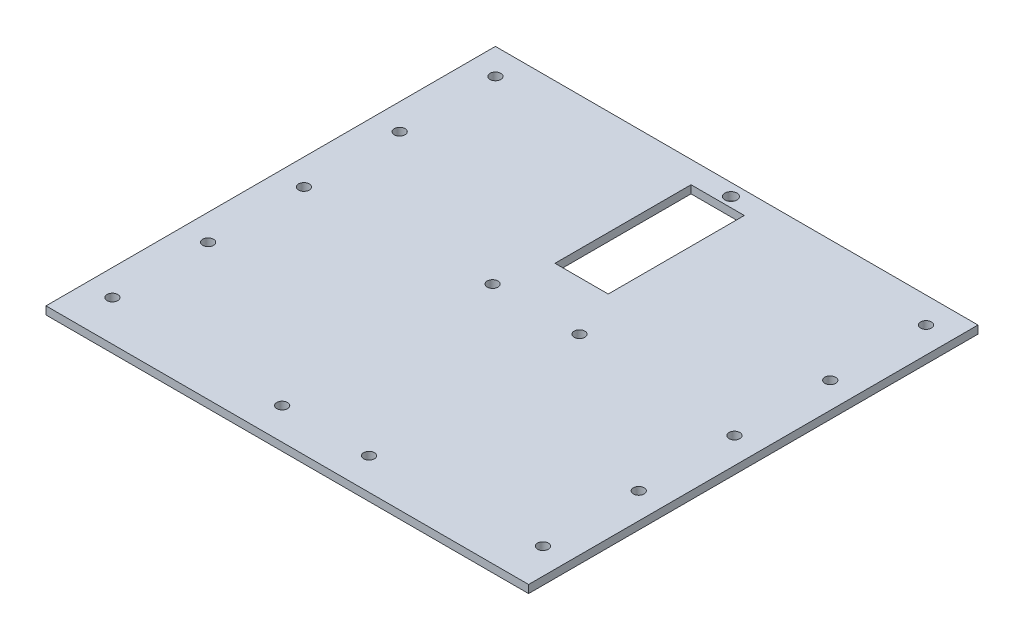
ISO-10303-21;
HEADER;
FILE_DESCRIPTION(('STEP AP214'),'2;1');
FILE_NAME('part.step','',(''),(''),'','','');
FILE_SCHEMA(('AUTOMOTIVE_DESIGN { 1 0 10303 214 1 1 1 1 }'));
ENDSEC;
DATA;
#1=APPLICATION_CONTEXT('core data for automotive mechanical design processes');
#2=APPLICATION_PROTOCOL_DEFINITION('international standard','automotive_design',2000,#1);
#3=PRODUCT_CONTEXT('',#1,'mechanical');
#4=PRODUCT('Part','Part','',(#3));
#5=PRODUCT_RELATED_PRODUCT_CATEGORY('part','',(#4));
#6=PRODUCT_DEFINITION_FORMATION('','',#4);
#7=PRODUCT_DEFINITION_CONTEXT('part definition',#1,'design');
#8=PRODUCT_DEFINITION('design','',#6,#7);
#9=PRODUCT_DEFINITION_SHAPE('','',#8);
#10=(LENGTH_UNIT() NAMED_UNIT(*) SI_UNIT(.MILLI.,.METRE.));
#11=(NAMED_UNIT(*) PLANE_ANGLE_UNIT() SI_UNIT($,.RADIAN.));
#12=(NAMED_UNIT(*) SI_UNIT($,.STERADIAN.) SOLID_ANGLE_UNIT());
#13=UNCERTAINTY_MEASURE_WITH_UNIT(LENGTH_MEASURE(1.E-05),#10,'distance_accuracy_value','');
#14=(GEOMETRIC_REPRESENTATION_CONTEXT(3) GLOBAL_UNCERTAINTY_ASSIGNED_CONTEXT((#13)) GLOBAL_UNIT_ASSIGNED_CONTEXT((#10,
#11,#12)) REPRESENTATION_CONTEXT('',''));
#15=CARTESIAN_POINT('',(0.,0.,0.));
#16=DIRECTION('',(0.,0.,1.));
#17=DIRECTION('',(1.,0.,0.));
#18=AXIS2_PLACEMENT_3D('',#15,#16,#17);
#19=CARTESIAN_POINT('',(-96.647,3.175,90.));
#20=DIRECTION('',(1.,0.,0.));
#21=DIRECTION('',(0.,0.,-1.));
#22=AXIS2_PLACEMENT_3D('',#19,#20,#21);
#23=PLANE('',#22);
#24=DIRECTION('',(0.,0.,1.));
#25=VECTOR('',#24,1.);
#26=CARTESIAN_POINT('',(-96.647,0.,90.));
#27=LINE('',#26,#25);
#28=CARTESIAN_POINT('',(-96.647,0.,-90.));
#29=VERTEX_POINT('',#28);
#30=CARTESIAN_POINT('',(-96.647,0.,90.));
#31=VERTEX_POINT('',#30);
#32=EDGE_CURVE('E225',#29,#31,#27,.T.);
#33=ORIENTED_EDGE('',*,*,#32,.T.);
#34=DIRECTION('',(0.,-1.,0.));
#35=VECTOR('',#34,1.);
#36=CARTESIAN_POINT('',(-96.647,3.175,90.));
#37=LINE('',#36,#35);
#38=CARTESIAN_POINT('',(-96.647,3.175,90.));
#39=VERTEX_POINT('',#38);
#40=EDGE_CURVE('E11',#39,#31,#37,.T.);
#41=ORIENTED_EDGE('',*,*,#40,.F.);
#42=DIRECTION('',(0.,0.,1.));
#43=VECTOR('',#42,1.);
#44=CARTESIAN_POINT('',(-96.647,3.175,90.));
#45=LINE('',#44,#43);
#46=CARTESIAN_POINT('',(-96.647,3.175,-90.));
#47=VERTEX_POINT('',#46);
#48=EDGE_CURVE('E228',#47,#39,#45,.T.);
#49=ORIENTED_EDGE('',*,*,#48,.F.);
#50=DIRECTION('',(0.,-1.,0.));
#51=VECTOR('',#50,1.);
#52=CARTESIAN_POINT('',(-96.647,3.175,-90.));
#53=LINE('',#52,#51);
#54=EDGE_CURVE('E238',#47,#29,#53,.T.);
#55=ORIENTED_EDGE('',*,*,#54,.T.);
#56=EDGE_LOOP('',(#33,#41,#49,#55));
#57=FACE_BOUND('',#56,.T.);
#58=ADVANCED_FACE('F37',(#57),#23,.F.);
#59=CARTESIAN_POINT('',(96.647,3.175,90.));
#60=DIRECTION('',(0.,0.,-1.));
#61=DIRECTION('',(-1.,0.,0.));
#62=AXIS2_PLACEMENT_3D('',#59,#60,#61);
#63=PLANE('',#62);
#64=DIRECTION('',(1.,0.,0.));
#65=VECTOR('',#64,1.);
#66=CARTESIAN_POINT('',(96.647,0.,90.));
#67=LINE('',#66,#65);
#68=CARTESIAN_POINT('',(96.647,0.,90.));
#69=VERTEX_POINT('',#68);
#70=EDGE_CURVE('E241',#31,#69,#67,.T.);
#71=ORIENTED_EDGE('',*,*,#70,.T.);
#72=DIRECTION('',(0.,-1.,0.));
#73=VECTOR('',#72,1.);
#74=CARTESIAN_POINT('',(96.647,3.175,90.));
#75=LINE('',#74,#73);
#76=CARTESIAN_POINT('',(96.647,3.175,90.));
#77=VERTEX_POINT('',#76);
#78=EDGE_CURVE('E44',#77,#69,#75,.T.);
#79=ORIENTED_EDGE('',*,*,#78,.F.);
#80=DIRECTION('',(1.,0.,0.));
#81=VECTOR('',#80,1.);
#82=CARTESIAN_POINT('',(96.647,3.175,90.));
#83=LINE('',#82,#81);
#84=EDGE_CURVE('E231',#39,#77,#83,.T.);
#85=ORIENTED_EDGE('',*,*,#84,.F.);
#86=ORIENTED_EDGE('',*,*,#40,.T.);
#87=EDGE_LOOP('',(#71,#79,#85,#86));
#88=FACE_BOUND('',#87,.T.);
#89=ADVANCED_FACE('F270',(#88),#63,.F.);
#90=CARTESIAN_POINT('',(96.647,3.175,90.));
#91=DIRECTION('',(-1.,0.,0.));
#92=DIRECTION('',(0.,0.,1.));
#93=AXIS2_PLACEMENT_3D('',#90,#91,#92);
#94=PLANE('',#93);
#95=DIRECTION('',(0.,0.,-1.));
#96=VECTOR('',#95,1.);
#97=CARTESIAN_POINT('',(96.647,0.,90.));
#98=LINE('',#97,#96);
#99=CARTESIAN_POINT('',(96.647,0.,-90.));
#100=VERTEX_POINT('',#99);
#101=EDGE_CURVE('E243',#69,#100,#98,.T.);
#102=ORIENTED_EDGE('',*,*,#101,.T.);
#103=DIRECTION('',(0.,-1.,0.));
#104=VECTOR('',#103,1.);
#105=CARTESIAN_POINT('',(96.647,3.175,-90.));
#106=LINE('',#105,#104);
#107=CARTESIAN_POINT('',(96.647,3.175,-90.));
#108=VERTEX_POINT('',#107);
#109=EDGE_CURVE('E248',#108,#100,#106,.T.);
#110=ORIENTED_EDGE('',*,*,#109,.F.);
#111=DIRECTION('',(0.,0.,-1.));
#112=VECTOR('',#111,1.);
#113=CARTESIAN_POINT('',(96.647,3.175,90.));
#114=LINE('',#113,#112);
#115=EDGE_CURVE('E234',#77,#108,#114,.T.);
#116=ORIENTED_EDGE('',*,*,#115,.F.);
#117=ORIENTED_EDGE('',*,*,#78,.T.);
#118=EDGE_LOOP('',(#102,#110,#116,#117));
#119=FACE_BOUND('',#118,.T.);
#120=ADVANCED_FACE('F255',(#119),#94,.F.);
#121=CARTESIAN_POINT('',(96.647,3.175,-90.));
#122=DIRECTION('',(0.,0.,1.));
#123=DIRECTION('',(1.,0.,0.));
#124=AXIS2_PLACEMENT_3D('',#121,#122,#123);
#125=PLANE('',#124);
#126=DIRECTION('',(-1.,0.,0.));
#127=VECTOR('',#126,1.);
#128=CARTESIAN_POINT('',(96.647,0.,-90.));
#129=LINE('',#128,#127);
#130=EDGE_CURVE('E232',#100,#29,#129,.T.);
#131=ORIENTED_EDGE('',*,*,#130,.T.);
#132=ORIENTED_EDGE('',*,*,#54,.F.);
#133=DIRECTION('',(-1.,0.,0.));
#134=VECTOR('',#133,1.);
#135=CARTESIAN_POINT('',(96.647,3.175,-90.));
#136=LINE('',#135,#134);
#137=EDGE_CURVE('E236',#108,#47,#136,.T.);
#138=ORIENTED_EDGE('',*,*,#137,.F.);
#139=ORIENTED_EDGE('',*,*,#109,.T.);
#140=EDGE_LOOP('',(#131,#132,#138,#139));
#141=FACE_BOUND('',#140,.T.);
#142=ADVANCED_FACE('F263',(#141),#125,.F.);
#143=CARTESIAN_POINT('',(0.,3.175,0.));
#144=DIRECTION('',(0.,1.,0.));
#145=DIRECTION('',(0.,0.,1.));
#146=AXIS2_PLACEMENT_3D('',#143,#144,#145);
#147=PLANE('',#146);
#148=DIRECTION('',(0.,0.,1.));
#149=VECTOR('',#148,1.);
#150=CARTESIAN_POINT('',(-9.47880327404497,3.175,-81.1914821692129));
#151=LINE('',#150,#149);
#152=CARTESIAN_POINT('',(-9.47880327404497,3.175,-81.1914821692129));
#153=VERTEX_POINT('',#152);
#154=CARTESIAN_POINT('',(-9.47880327404497,3.175,-26.6912080595729));
#155=VERTEX_POINT('',#154);
#156=EDGE_CURVE('E51',#153,#155,#151,.T.);
#157=ORIENTED_EDGE('',*,*,#156,.F.);
#158=DIRECTION('',(-1.,0.,0.));
#159=VECTOR('',#158,1.);
#160=CARTESIAN_POINT('',(-9.47880327404497,3.175,-81.1914821692129));
#161=LINE('',#160,#159);
#162=CARTESIAN_POINT('',(11.8516451207513,3.175,-81.1914821692129));
#163=VERTEX_POINT('',#162);
#164=EDGE_CURVE('E119',#163,#153,#161,.T.);
#165=ORIENTED_EDGE('',*,*,#164,.F.);
#166=DIRECTION('',(0.,0.,-1.));
#167=VECTOR('',#166,1.);
#168=CARTESIAN_POINT('',(11.8516451207513,3.175,-81.1914821692129));
#169=LINE('',#168,#167);
#170=CARTESIAN_POINT('',(11.8516451207513,3.175,-26.6912080595729));
#171=VERTEX_POINT('',#170);
#172=EDGE_CURVE('E122',#171,#163,#169,.T.);
#173=ORIENTED_EDGE('',*,*,#172,.F.);
#174=DIRECTION('',(1.,0.,0.));
#175=VECTOR('',#174,1.);
#176=CARTESIAN_POINT('',(-9.47880327404497,3.175,-26.6912080595729));
#177=LINE('',#176,#175);
#178=EDGE_CURVE('E128',#155,#171,#177,.T.);
#179=ORIENTED_EDGE('',*,*,#178,.F.);
#180=EDGE_LOOP('',(#157,#165,#173,#179));
#181=FACE_BOUND('',#180,.T.);
#182=CARTESIAN_POINT('',(2.60360651999997,3.175,-85.0800513353116));
#183=DIRECTION('',(0.,1.,0.));
#184=DIRECTION('',(0.,0.,1.));
#185=AXIS2_PLACEMENT_3D('',#182,#183,#184);
#186=CIRCLE('',#185,2.41534122918814);
#187=CARTESIAN_POINT('',(2.60360651999997,3.175,-82.6647101061235));
#188=VERTEX_POINT('',#187);
#189=EDGE_CURVE('E134',#188,#188,#186,.T.);
#190=ORIENTED_EDGE('',*,*,#189,.F.);
#191=EDGE_LOOP('',(#190));
#192=FACE_BOUND('',#191,.T.);
#193=CARTESIAN_POINT('',(-14.76439348,3.175,77.3));
#194=DIRECTION('',(0.,1.,0.));
#195=DIRECTION('',(0.,0.,1.));
#196=AXIS2_PLACEMENT_3D('',#193,#194,#195);
#197=CIRCLE('',#196,2.159);
#198=CARTESIAN_POINT('',(-14.76439348,3.175,79.459));
#199=VERTEX_POINT('',#198);
#200=EDGE_CURVE('E154',#199,#199,#197,.T.);
#201=ORIENTED_EDGE('',*,*,#200,.F.);
#202=EDGE_LOOP('',(#201));
#203=FACE_BOUND('',#202,.T.);
#204=CARTESIAN_POINT('',(20.03360652,3.175,77.3));
#205=DIRECTION('',(0.,1.,0.));
#206=DIRECTION('',(0.,0.,1.));
#207=AXIS2_PLACEMENT_3D('',#204,#205,#206);
#208=CIRCLE('',#207,2.15899999999999);
#209=CARTESIAN_POINT('',(20.03360652,3.175,79.459));
#210=VERTEX_POINT('',#209);
#211=EDGE_CURVE('E148',#210,#210,#208,.T.);
#212=ORIENTED_EDGE('',*,*,#211,.F.);
#213=EDGE_LOOP('',(#212));
#214=FACE_BOUND('',#213,.T.);
#215=CARTESIAN_POINT('',(20.03360652,3.175,-7.00223307053754));
#216=DIRECTION('',(0.,1.,0.));
#217=DIRECTION('',(0.,0.,1.));
#218=AXIS2_PLACEMENT_3D('',#215,#216,#217);
#219=CIRCLE('',#218,2.159);
#220=CARTESIAN_POINT('',(20.03360652,3.175,-4.84323307053754));
#221=VERTEX_POINT('',#220);
#222=EDGE_CURVE('E142',#221,#221,#219,.T.);
#223=ORIENTED_EDGE('',*,*,#222,.F.);
#224=EDGE_LOOP('',(#223));
#225=FACE_BOUND('',#224,.T.);
#226=CARTESIAN_POINT('',(-14.76439348,3.175,-7.00223307053754));
#227=DIRECTION('',(0.,1.,0.));
#228=DIRECTION('',(0.,0.,1.));
#229=AXIS2_PLACEMENT_3D('',#226,#227,#228);
#230=CIRCLE('',#229,2.159);
#231=CARTESIAN_POINT('',(-14.76439348,3.175,-4.84323307053754));
#232=VERTEX_POINT('',#231);
#233=EDGE_CURVE('E141',#232,#232,#230,.T.);
#234=ORIENTED_EDGE('',*,*,#233,.F.);
#235=EDGE_LOOP('',(#234));
#236=FACE_BOUND('',#235,.T.);
#237=CARTESIAN_POINT('',(86.233,3.175,-79.586));
#238=DIRECTION('',(0.,1.,0.));
#239=DIRECTION('',(0.,0.,1.));
#240=AXIS2_PLACEMENT_3D('',#237,#238,#239);
#241=CIRCLE('',#240,2.15899999999999);
#242=CARTESIAN_POINT('',(86.233,3.175,-77.427));
#243=VERTEX_POINT('',#242);
#244=EDGE_CURVE('E178',#243,#243,#241,.T.);
#245=ORIENTED_EDGE('',*,*,#244,.F.);
#246=EDGE_LOOP('',(#245));
#247=FACE_BOUND('',#246,.T.);
#248=CARTESIAN_POINT('',(86.2330000000015,3.175,-41.232));
#249=DIRECTION('',(0.,1.,0.));
#250=DIRECTION('',(0.,0.,1.));
#251=AXIS2_PLACEMENT_3D('',#248,#249,#250);
#252=CIRCLE('',#251,2.15899999999999);
#253=CARTESIAN_POINT('',(86.2330000000015,3.175,-39.073));
#254=VERTEX_POINT('',#253);
#255=EDGE_CURVE('E184',#254,#254,#252,.T.);
#256=ORIENTED_EDGE('',*,*,#255,.F.);
#257=EDGE_LOOP('',(#256));
#258=FACE_BOUND('',#257,.T.);
#259=CARTESIAN_POINT('',(86.2330000000029,3.175,-2.87799999999999));
#260=DIRECTION('',(0.,1.,0.));
#261=DIRECTION('',(0.,0.,1.));
#262=AXIS2_PLACEMENT_3D('',#259,#260,#261);
#263=CIRCLE('',#262,2.15899999999999);
#264=CARTESIAN_POINT('',(86.2330000000029,3.175,-0.718999999999998));
#265=VERTEX_POINT('',#264);
#266=EDGE_CURVE('E190',#265,#265,#263,.T.);
#267=ORIENTED_EDGE('',*,*,#266,.F.);
#268=EDGE_LOOP('',(#267));
#269=FACE_BOUND('',#268,.T.);
#270=CARTESIAN_POINT('',(86.2330000000044,3.175,35.476));
#271=DIRECTION('',(0.,1.,0.));
#272=DIRECTION('',(0.,0.,1.));
#273=AXIS2_PLACEMENT_3D('',#270,#271,#272);
#274=CIRCLE('',#273,2.15899999999999);
#275=CARTESIAN_POINT('',(86.2330000000044,3.175,37.635));
#276=VERTEX_POINT('',#275);
#277=EDGE_CURVE('E196',#276,#276,#274,.T.);
#278=ORIENTED_EDGE('',*,*,#277,.F.);
#279=EDGE_LOOP('',(#278));
#280=FACE_BOUND('',#279,.T.);
#281=CARTESIAN_POINT('',(-86.2329999999985,3.175,-41.232));
#282=DIRECTION('',(0.,1.,0.));
#283=DIRECTION('',(0.,0.,1.));
#284=AXIS2_PLACEMENT_3D('',#281,#282,#283);
#285=CIRCLE('',#284,2.15899999999999);
#286=CARTESIAN_POINT('',(-86.2329999999985,3.175,-39.073));
#287=VERTEX_POINT('',#286);
#288=EDGE_CURVE('E202',#287,#287,#285,.T.);
#289=ORIENTED_EDGE('',*,*,#288,.F.);
#290=EDGE_LOOP('',(#289));
#291=FACE_BOUND('',#290,.T.);
#292=CARTESIAN_POINT('',(-86.232999999997,3.175,-2.87799999999999));
#293=DIRECTION('',(0.,1.,0.));
#294=DIRECTION('',(0.,0.,1.));
#295=AXIS2_PLACEMENT_3D('',#292,#293,#294);
#296=CIRCLE('',#295,2.15899999999999);
#297=CARTESIAN_POINT('',(-86.232999999997,3.175,-0.718999999999998));
#298=VERTEX_POINT('',#297);
#299=EDGE_CURVE('E208',#298,#298,#296,.T.);
#300=ORIENTED_EDGE('',*,*,#299,.F.);
#301=EDGE_LOOP('',(#300));
#302=FACE_BOUND('',#301,.T.);
#303=CARTESIAN_POINT('',(-86.2329999999956,3.175,35.476));
#304=DIRECTION('',(0.,1.,0.));
#305=DIRECTION('',(0.,0.,1.));
#306=AXIS2_PLACEMENT_3D('',#303,#304,#305);
#307=CIRCLE('',#306,2.15899999999999);
#308=CARTESIAN_POINT('',(-86.2329999999956,3.175,37.635));
#309=VERTEX_POINT('',#308);
#310=EDGE_CURVE('E214',#309,#309,#307,.T.);
#311=ORIENTED_EDGE('',*,*,#310,.F.);
#312=EDGE_LOOP('',(#311));
#313=FACE_BOUND('',#312,.T.);
#314=CARTESIAN_POINT('',(-86.2329999999941,3.175,73.83));
#315=DIRECTION('',(0.,1.,0.));
#316=DIRECTION('',(0.,0.,1.));
#317=AXIS2_PLACEMENT_3D('',#314,#315,#316);
#318=CIRCLE('',#317,2.15899999999999);
#319=CARTESIAN_POINT('',(-86.2329999999941,3.175,75.989));
#320=VERTEX_POINT('',#319);
#321=EDGE_CURVE('E171',#320,#320,#318,.T.);
#322=ORIENTED_EDGE('',*,*,#321,.F.);
#323=EDGE_LOOP('',(#322));
#324=FACE_BOUND('',#323,.T.);
#325=CARTESIAN_POINT('',(86.2330000000059,3.175,73.83));
#326=DIRECTION('',(0.,1.,0.));
#327=DIRECTION('',(0.,0.,1.));
#328=AXIS2_PLACEMENT_3D('',#325,#326,#327);
#329=CIRCLE('',#328,2.15899999999999);
#330=CARTESIAN_POINT('',(86.2330000000059,3.175,75.989));
#331=VERTEX_POINT('',#330);
#332=EDGE_CURVE('E165',#331,#331,#329,.T.);
#333=ORIENTED_EDGE('',*,*,#332,.F.);
#334=EDGE_LOOP('',(#333));
#335=FACE_BOUND('',#334,.T.);
#336=CARTESIAN_POINT('',(-86.233,3.175,-79.586));
#337=DIRECTION('',(0.,1.,0.));
#338=DIRECTION('',(0.,0.,1.));
#339=AXIS2_PLACEMENT_3D('',#336,#337,#338);
#340=CIRCLE('',#339,2.15899999999999);
#341=CARTESIAN_POINT('',(-86.233,3.175,-77.427));
#342=VERTEX_POINT('',#341);
#343=EDGE_CURVE('E177',#342,#342,#340,.T.);
#344=ORIENTED_EDGE('',*,*,#343,.F.);
#345=EDGE_LOOP('',(#344));
#346=FACE_BOUND('',#345,.T.);
#347=ORIENTED_EDGE('',*,*,#48,.T.);
#348=ORIENTED_EDGE('',*,*,#84,.T.);
#349=ORIENTED_EDGE('',*,*,#115,.T.);
#350=ORIENTED_EDGE('',*,*,#137,.T.);
#351=EDGE_LOOP('',(#347,#348,#349,#350));
#352=FACE_BOUND('',#351,.T.);
#353=ADVANCED_FACE('F269',(#181,#192,#203,#214,#225,#236,#247,#258,#269,#280,#291,#302,#313,
#324,#335,#346,#352),#147,.T.);
#354=CARTESIAN_POINT('',(0.,0.,0.));
#355=DIRECTION('',(0.,1.,0.));
#356=DIRECTION('',(0.,0.,1.));
#357=AXIS2_PLACEMENT_3D('',#354,#355,#356);
#358=PLANE('',#357);
#359=DIRECTION('',(-1.,0.,0.));
#360=VECTOR('',#359,1.);
#361=CARTESIAN_POINT('',(-9.47880327404497,0.,-81.1914821692129));
#362=LINE('',#361,#360);
#363=CARTESIAN_POINT('',(11.8516451207513,0.,-81.1914821692129));
#364=VERTEX_POINT('',#363);
#365=CARTESIAN_POINT('',(-9.47880327404497,0.,-81.1914821692129));
#366=VERTEX_POINT('',#365);
#367=EDGE_CURVE('E109',#364,#366,#362,.T.);
#368=ORIENTED_EDGE('',*,*,#367,.T.);
#369=DIRECTION('',(0.,0.,1.));
#370=VECTOR('',#369,1.);
#371=CARTESIAN_POINT('',(-9.47880327404497,0.,-81.1914821692129));
#372=LINE('',#371,#370);
#373=CARTESIAN_POINT('',(-9.47880327404497,0.,-26.6912080595729));
#374=VERTEX_POINT('',#373);
#375=EDGE_CURVE('E103',#366,#374,#372,.T.);
#376=ORIENTED_EDGE('',*,*,#375,.T.);
#377=DIRECTION('',(1.,0.,0.));
#378=VECTOR('',#377,1.);
#379=CARTESIAN_POINT('',(-9.47880327404497,0.,-26.6912080595729));
#380=LINE('',#379,#378);
#381=CARTESIAN_POINT('',(11.8516451207513,0.,-26.6912080595729));
#382=VERTEX_POINT('',#381);
#383=EDGE_CURVE('E112',#374,#382,#380,.T.);
#384=ORIENTED_EDGE('',*,*,#383,.T.);
#385=DIRECTION('',(0.,0.,-1.));
#386=VECTOR('',#385,1.);
#387=CARTESIAN_POINT('',(11.8516451207513,0.,-81.1914821692129));
#388=LINE('',#387,#386);
#389=EDGE_CURVE('E59',#382,#364,#388,.T.);
#390=ORIENTED_EDGE('',*,*,#389,.T.);
#391=EDGE_LOOP('',(#368,#376,#384,#390));
#392=FACE_BOUND('',#391,.T.);
#393=CARTESIAN_POINT('',(2.60360651999997,0.,-85.0800513353116));
#394=DIRECTION('',(0.,1.,0.));
#395=DIRECTION('',(0.,0.,1.));
#396=AXIS2_PLACEMENT_3D('',#393,#394,#395);
#397=CIRCLE('',#396,2.41534122918814);
#398=CARTESIAN_POINT('',(2.60360651999997,0.,-82.6647101061235));
#399=VERTEX_POINT('',#398);
#400=EDGE_CURVE('E157',#399,#399,#397,.T.);
#401=ORIENTED_EDGE('',*,*,#400,.T.);
#402=EDGE_LOOP('',(#401));
#403=FACE_BOUND('',#402,.T.);
#404=CARTESIAN_POINT('',(-14.76439348,0.,77.3));
#405=DIRECTION('',(0.,1.,0.));
#406=DIRECTION('',(0.,0.,1.));
#407=AXIS2_PLACEMENT_3D('',#404,#405,#406);
#408=CIRCLE('',#407,2.159);
#409=CARTESIAN_POINT('',(-14.76439348,0.,79.459));
#410=VERTEX_POINT('',#409);
#411=EDGE_CURVE('E151',#410,#410,#408,.T.);
#412=ORIENTED_EDGE('',*,*,#411,.T.);
#413=EDGE_LOOP('',(#412));
#414=FACE_BOUND('',#413,.T.);
#415=CARTESIAN_POINT('',(20.03360652,0.,77.3));
#416=DIRECTION('',(0.,1.,0.));
#417=DIRECTION('',(0.,0.,1.));
#418=AXIS2_PLACEMENT_3D('',#415,#416,#417);
#419=CIRCLE('',#418,2.15899999999999);
#420=CARTESIAN_POINT('',(20.03360652,0.,79.459));
#421=VERTEX_POINT('',#420);
#422=EDGE_CURVE('E145',#421,#421,#419,.T.);
#423=ORIENTED_EDGE('',*,*,#422,.T.);
#424=EDGE_LOOP('',(#423));
#425=FACE_BOUND('',#424,.T.);
#426=CARTESIAN_POINT('',(20.03360652,0.,-7.00223307053754));
#427=DIRECTION('',(0.,1.,0.));
#428=DIRECTION('',(0.,0.,1.));
#429=AXIS2_PLACEMENT_3D('',#426,#427,#428);
#430=CIRCLE('',#429,2.159);
#431=CARTESIAN_POINT('',(20.03360652,0.,-4.84323307053754));
#432=VERTEX_POINT('',#431);
#433=EDGE_CURVE('E138',#432,#432,#430,.T.);
#434=ORIENTED_EDGE('',*,*,#433,.T.);
#435=EDGE_LOOP('',(#434));
#436=FACE_BOUND('',#435,.T.);
#437=CARTESIAN_POINT('',(-14.76439348,0.,-7.00223307053754));
#438=DIRECTION('',(0.,1.,0.));
#439=DIRECTION('',(0.,0.,1.));
#440=AXIS2_PLACEMENT_3D('',#437,#438,#439);
#441=CIRCLE('',#440,2.159);
#442=CARTESIAN_POINT('',(-14.76439348,0.,-4.84323307053754));
#443=VERTEX_POINT('',#442);
#444=EDGE_CURVE('E162',#443,#443,#441,.T.);
#445=ORIENTED_EDGE('',*,*,#444,.T.);
#446=EDGE_LOOP('',(#445));
#447=FACE_BOUND('',#446,.T.);
#448=CARTESIAN_POINT('',(86.233,0.,-79.586));
#449=DIRECTION('',(0.,1.,0.));
#450=DIRECTION('',(0.,0.,1.));
#451=AXIS2_PLACEMENT_3D('',#448,#449,#450);
#452=CIRCLE('',#451,2.15899999999999);
#453=CARTESIAN_POINT('',(86.233,0.,-77.427));
#454=VERTEX_POINT('',#453);
#455=EDGE_CURVE('E174',#454,#454,#452,.T.);
#456=ORIENTED_EDGE('',*,*,#455,.T.);
#457=EDGE_LOOP('',(#456));
#458=FACE_BOUND('',#457,.T.);
#459=CARTESIAN_POINT('',(86.2330000000015,0.,-41.232));
#460=DIRECTION('',(0.,1.,0.));
#461=DIRECTION('',(0.,0.,1.));
#462=AXIS2_PLACEMENT_3D('',#459,#460,#461);
#463=CIRCLE('',#462,2.15899999999999);
#464=CARTESIAN_POINT('',(86.2330000000015,0.,-39.073));
#465=VERTEX_POINT('',#464);
#466=EDGE_CURVE('E181',#465,#465,#463,.T.);
#467=ORIENTED_EDGE('',*,*,#466,.T.);
#468=EDGE_LOOP('',(#467));
#469=FACE_BOUND('',#468,.T.);
#470=CARTESIAN_POINT('',(86.2330000000029,0.,-2.87799999999999));
#471=DIRECTION('',(0.,1.,0.));
#472=DIRECTION('',(0.,0.,1.));
#473=AXIS2_PLACEMENT_3D('',#470,#471,#472);
#474=CIRCLE('',#473,2.15899999999999);
#475=CARTESIAN_POINT('',(86.2330000000029,0.,-0.718999999999998));
#476=VERTEX_POINT('',#475);
#477=EDGE_CURVE('E187',#476,#476,#474,.T.);
#478=ORIENTED_EDGE('',*,*,#477,.T.);
#479=EDGE_LOOP('',(#478));
#480=FACE_BOUND('',#479,.T.);
#481=CARTESIAN_POINT('',(86.2330000000044,0.,35.476));
#482=DIRECTION('',(0.,1.,0.));
#483=DIRECTION('',(0.,0.,1.));
#484=AXIS2_PLACEMENT_3D('',#481,#482,#483);
#485=CIRCLE('',#484,2.15899999999999);
#486=CARTESIAN_POINT('',(86.2330000000044,0.,37.635));
#487=VERTEX_POINT('',#486);
#488=EDGE_CURVE('E193',#487,#487,#485,.T.);
#489=ORIENTED_EDGE('',*,*,#488,.T.);
#490=EDGE_LOOP('',(#489));
#491=FACE_BOUND('',#490,.T.);
#492=CARTESIAN_POINT('',(-86.2329999999985,0.,-41.232));
#493=DIRECTION('',(0.,1.,0.));
#494=DIRECTION('',(0.,0.,1.));
#495=AXIS2_PLACEMENT_3D('',#492,#493,#494);
#496=CIRCLE('',#495,2.15899999999999);
#497=CARTESIAN_POINT('',(-86.2329999999985,0.,-39.073));
#498=VERTEX_POINT('',#497);
#499=EDGE_CURVE('E199',#498,#498,#496,.T.);
#500=ORIENTED_EDGE('',*,*,#499,.T.);
#501=EDGE_LOOP('',(#500));
#502=FACE_BOUND('',#501,.T.);
#503=CARTESIAN_POINT('',(-86.232999999997,0.,-2.87799999999999));
#504=DIRECTION('',(0.,1.,0.));
#505=DIRECTION('',(0.,0.,1.));
#506=AXIS2_PLACEMENT_3D('',#503,#504,#505);
#507=CIRCLE('',#506,2.15899999999999);
#508=CARTESIAN_POINT('',(-86.232999999997,0.,-0.718999999999998));
#509=VERTEX_POINT('',#508);
#510=EDGE_CURVE('E205',#509,#509,#507,.T.);
#511=ORIENTED_EDGE('',*,*,#510,.T.);
#512=EDGE_LOOP('',(#511));
#513=FACE_BOUND('',#512,.T.);
#514=CARTESIAN_POINT('',(-86.2329999999956,0.,35.476));
#515=DIRECTION('',(0.,1.,0.));
#516=DIRECTION('',(0.,0.,1.));
#517=AXIS2_PLACEMENT_3D('',#514,#515,#516);
#518=CIRCLE('',#517,2.15899999999999);
#519=CARTESIAN_POINT('',(-86.2329999999956,0.,37.635));
#520=VERTEX_POINT('',#519);
#521=EDGE_CURVE('E211',#520,#520,#518,.T.);
#522=ORIENTED_EDGE('',*,*,#521,.T.);
#523=EDGE_LOOP('',(#522));
#524=FACE_BOUND('',#523,.T.);
#525=CARTESIAN_POINT('',(-86.2329999999941,0.,73.83));
#526=DIRECTION('',(0.,1.,0.));
#527=DIRECTION('',(0.,0.,1.));
#528=AXIS2_PLACEMENT_3D('',#525,#526,#527);
#529=CIRCLE('',#528,2.15899999999999);
#530=CARTESIAN_POINT('',(-86.2329999999941,0.,75.989));
#531=VERTEX_POINT('',#530);
#532=EDGE_CURVE('E217',#531,#531,#529,.T.);
#533=ORIENTED_EDGE('',*,*,#532,.T.);
#534=EDGE_LOOP('',(#533));
#535=FACE_BOUND('',#534,.T.);
#536=CARTESIAN_POINT('',(86.2330000000059,0.,73.83));
#537=DIRECTION('',(0.,1.,0.));
#538=DIRECTION('',(0.,0.,1.));
#539=AXIS2_PLACEMENT_3D('',#536,#537,#538);
#540=CIRCLE('',#539,2.15899999999999);
#541=CARTESIAN_POINT('',(86.2330000000059,0.,75.989));
#542=VERTEX_POINT('',#541);
#543=EDGE_CURVE('E168',#542,#542,#540,.T.);
#544=ORIENTED_EDGE('',*,*,#543,.T.);
#545=EDGE_LOOP('',(#544));
#546=FACE_BOUND('',#545,.T.);
#547=CARTESIAN_POINT('',(-86.233,0.,-79.586));
#548=DIRECTION('',(0.,1.,0.));
#549=DIRECTION('',(0.,0.,1.));
#550=AXIS2_PLACEMENT_3D('',#547,#548,#549);
#551=CIRCLE('',#550,2.15899999999999);
#552=CARTESIAN_POINT('',(-86.233,0.,-77.427));
#553=VERTEX_POINT('',#552);
#554=EDGE_CURVE('E222',#553,#553,#551,.T.);
#555=ORIENTED_EDGE('',*,*,#554,.T.);
#556=EDGE_LOOP('',(#555));
#557=FACE_BOUND('',#556,.T.);
#558=ORIENTED_EDGE('',*,*,#32,.F.);
#559=ORIENTED_EDGE('',*,*,#130,.F.);
#560=ORIENTED_EDGE('',*,*,#101,.F.);
#561=ORIENTED_EDGE('',*,*,#70,.F.);
#562=EDGE_LOOP('',(#558,#559,#560,#561));
#563=FACE_BOUND('',#562,.T.);
#564=ADVANCED_FACE('F116',(#392,#403,#414,#425,#436,#447,#458,#469,#480,#491,#502,#513,#524,
#535,#546,#557,#563),#358,.F.);
#565=CARTESIAN_POINT('',(-86.233,0.,-79.586));
#566=DIRECTION('',(0.,1.,0.));
#567=DIRECTION('',(0.,0.,1.));
#568=AXIS2_PLACEMENT_3D('',#565,#566,#567);
#569=CYLINDRICAL_SURFACE('',#568,2.15899999999999);
#570=ORIENTED_EDGE('',*,*,#554,.F.);
#571=EDGE_LOOP('',(#570));
#572=FACE_BOUND('',#571,.T.);
#573=ORIENTED_EDGE('',*,*,#343,.T.);
#574=EDGE_LOOP('',(#573));
#575=FACE_BOUND('',#574,.T.);
#576=ADVANCED_FACE('F282',(#572,#575),#569,.F.);
#577=CARTESIAN_POINT('',(86.2330000000059,0.,73.83));
#578=DIRECTION('',(0.,1.,0.));
#579=DIRECTION('',(0.,0.,1.));
#580=AXIS2_PLACEMENT_3D('',#577,#578,#579);
#581=CYLINDRICAL_SURFACE('',#580,2.15899999999999);
#582=ORIENTED_EDGE('',*,*,#543,.F.);
#583=EDGE_LOOP('',(#582));
#584=FACE_BOUND('',#583,.T.);
#585=ORIENTED_EDGE('',*,*,#332,.T.);
#586=EDGE_LOOP('',(#585));
#587=FACE_BOUND('',#586,.T.);
#588=ADVANCED_FACE('F288',(#584,#587),#581,.F.);
#589=CARTESIAN_POINT('',(-86.2329999999941,0.,73.83));
#590=DIRECTION('',(0.,1.,0.));
#591=DIRECTION('',(0.,0.,1.));
#592=AXIS2_PLACEMENT_3D('',#589,#590,#591);
#593=CYLINDRICAL_SURFACE('',#592,2.15899999999999);
#594=ORIENTED_EDGE('',*,*,#532,.F.);
#595=EDGE_LOOP('',(#594));
#596=FACE_BOUND('',#595,.T.);
#597=ORIENTED_EDGE('',*,*,#321,.T.);
#598=EDGE_LOOP('',(#597));
#599=FACE_BOUND('',#598,.T.);
#600=ADVANCED_FACE('F290',(#596,#599),#593,.F.);
#601=CARTESIAN_POINT('',(-86.2329999999956,0.,35.476));
#602=DIRECTION('',(0.,1.,0.));
#603=DIRECTION('',(0.,0.,1.));
#604=AXIS2_PLACEMENT_3D('',#601,#602,#603);
#605=CYLINDRICAL_SURFACE('',#604,2.15899999999999);
#606=ORIENTED_EDGE('',*,*,#521,.F.);
#607=EDGE_LOOP('',(#606));
#608=FACE_BOUND('',#607,.T.);
#609=ORIENTED_EDGE('',*,*,#310,.T.);
#610=EDGE_LOOP('',(#609));
#611=FACE_BOUND('',#610,.T.);
#612=ADVANCED_FACE('F293',(#608,#611),#605,.F.);
#613=CARTESIAN_POINT('',(-86.232999999997,0.,-2.87799999999999));
#614=DIRECTION('',(0.,1.,0.));
#615=DIRECTION('',(0.,0.,1.));
#616=AXIS2_PLACEMENT_3D('',#613,#614,#615);
#617=CYLINDRICAL_SURFACE('',#616,2.15899999999999);
#618=ORIENTED_EDGE('',*,*,#510,.F.);
#619=EDGE_LOOP('',(#618));
#620=FACE_BOUND('',#619,.T.);
#621=ORIENTED_EDGE('',*,*,#299,.T.);
#622=EDGE_LOOP('',(#621));
#623=FACE_BOUND('',#622,.T.);
#624=ADVANCED_FACE('F297',(#620,#623),#617,.F.);
#625=CARTESIAN_POINT('',(-86.2329999999985,0.,-41.232));
#626=DIRECTION('',(0.,1.,0.));
#627=DIRECTION('',(0.,0.,1.));
#628=AXIS2_PLACEMENT_3D('',#625,#626,#627);
#629=CYLINDRICAL_SURFACE('',#628,2.15899999999999);
#630=ORIENTED_EDGE('',*,*,#499,.F.);
#631=EDGE_LOOP('',(#630));
#632=FACE_BOUND('',#631,.T.);
#633=ORIENTED_EDGE('',*,*,#288,.T.);
#634=EDGE_LOOP('',(#633));
#635=FACE_BOUND('',#634,.T.);
#636=ADVANCED_FACE('F301',(#632,#635),#629,.F.);
#637=CARTESIAN_POINT('',(86.2330000000044,0.,35.476));
#638=DIRECTION('',(0.,1.,0.));
#639=DIRECTION('',(0.,0.,1.));
#640=AXIS2_PLACEMENT_3D('',#637,#638,#639);
#641=CYLINDRICAL_SURFACE('',#640,2.15899999999999);
#642=ORIENTED_EDGE('',*,*,#488,.F.);
#643=EDGE_LOOP('',(#642));
#644=FACE_BOUND('',#643,.T.);
#645=ORIENTED_EDGE('',*,*,#277,.T.);
#646=EDGE_LOOP('',(#645));
#647=FACE_BOUND('',#646,.T.);
#648=ADVANCED_FACE('F305',(#644,#647),#641,.F.);
#649=CARTESIAN_POINT('',(86.2330000000029,0.,-2.87799999999999));
#650=DIRECTION('',(0.,1.,0.));
#651=DIRECTION('',(0.,0.,1.));
#652=AXIS2_PLACEMENT_3D('',#649,#650,#651);
#653=CYLINDRICAL_SURFACE('',#652,2.15899999999999);
#654=ORIENTED_EDGE('',*,*,#477,.F.);
#655=EDGE_LOOP('',(#654));
#656=FACE_BOUND('',#655,.T.);
#657=ORIENTED_EDGE('',*,*,#266,.T.);
#658=EDGE_LOOP('',(#657));
#659=FACE_BOUND('',#658,.T.);
#660=ADVANCED_FACE('F309',(#656,#659),#653,.F.);
#661=CARTESIAN_POINT('',(86.2330000000015,0.,-41.232));
#662=DIRECTION('',(0.,1.,0.));
#663=DIRECTION('',(0.,0.,1.));
#664=AXIS2_PLACEMENT_3D('',#661,#662,#663);
#665=CYLINDRICAL_SURFACE('',#664,2.15899999999999);
#666=ORIENTED_EDGE('',*,*,#466,.F.);
#667=EDGE_LOOP('',(#666));
#668=FACE_BOUND('',#667,.T.);
#669=ORIENTED_EDGE('',*,*,#255,.T.);
#670=EDGE_LOOP('',(#669));
#671=FACE_BOUND('',#670,.T.);
#672=ADVANCED_FACE('F313',(#668,#671),#665,.F.);
#673=CARTESIAN_POINT('',(86.233,0.,-79.586));
#674=DIRECTION('',(0.,1.,0.));
#675=DIRECTION('',(0.,0.,1.));
#676=AXIS2_PLACEMENT_3D('',#673,#674,#675);
#677=CYLINDRICAL_SURFACE('',#676,2.15899999999999);
#678=ORIENTED_EDGE('',*,*,#455,.F.);
#679=EDGE_LOOP('',(#678));
#680=FACE_BOUND('',#679,.T.);
#681=ORIENTED_EDGE('',*,*,#244,.T.);
#682=EDGE_LOOP('',(#681));
#683=FACE_BOUND('',#682,.T.);
#684=ADVANCED_FACE('F317',(#680,#683),#677,.F.);
#685=CARTESIAN_POINT('',(-14.76439348,0.,-7.00223307053754));
#686=DIRECTION('',(0.,1.,0.));
#687=DIRECTION('',(0.,0.,1.));
#688=AXIS2_PLACEMENT_3D('',#685,#686,#687);
#689=CYLINDRICAL_SURFACE('',#688,2.159);
#690=ORIENTED_EDGE('',*,*,#444,.F.);
#691=EDGE_LOOP('',(#690));
#692=FACE_BOUND('',#691,.T.);
#693=ORIENTED_EDGE('',*,*,#233,.T.);
#694=EDGE_LOOP('',(#693));
#695=FACE_BOUND('',#694,.T.);
#696=ADVANCED_FACE('F321',(#692,#695),#689,.F.);
#697=CARTESIAN_POINT('',(20.03360652,0.,-7.00223307053754));
#698=DIRECTION('',(0.,1.,0.));
#699=DIRECTION('',(0.,0.,1.));
#700=AXIS2_PLACEMENT_3D('',#697,#698,#699);
#701=CYLINDRICAL_SURFACE('',#700,2.159);
#702=ORIENTED_EDGE('',*,*,#433,.F.);
#703=EDGE_LOOP('',(#702));
#704=FACE_BOUND('',#703,.T.);
#705=ORIENTED_EDGE('',*,*,#222,.T.);
#706=EDGE_LOOP('',(#705));
#707=FACE_BOUND('',#706,.T.);
#708=ADVANCED_FACE('F328',(#704,#707),#701,.F.);
#709=CARTESIAN_POINT('',(20.03360652,0.,77.3));
#710=DIRECTION('',(0.,1.,0.));
#711=DIRECTION('',(0.,0.,1.));
#712=AXIS2_PLACEMENT_3D('',#709,#710,#711);
#713=CYLINDRICAL_SURFACE('',#712,2.15899999999999);
#714=ORIENTED_EDGE('',*,*,#422,.F.);
#715=EDGE_LOOP('',(#714));
#716=FACE_BOUND('',#715,.T.);
#717=ORIENTED_EDGE('',*,*,#211,.T.);
#718=EDGE_LOOP('',(#717));
#719=FACE_BOUND('',#718,.T.);
#720=ADVANCED_FACE('F337',(#716,#719),#713,.F.);
#721=CARTESIAN_POINT('',(-14.76439348,0.,77.3));
#722=DIRECTION('',(0.,1.,0.));
#723=DIRECTION('',(0.,0.,1.));
#724=AXIS2_PLACEMENT_3D('',#721,#722,#723);
#725=CYLINDRICAL_SURFACE('',#724,2.159);
#726=ORIENTED_EDGE('',*,*,#411,.F.);
#727=EDGE_LOOP('',(#726));
#728=FACE_BOUND('',#727,.T.);
#729=ORIENTED_EDGE('',*,*,#200,.T.);
#730=EDGE_LOOP('',(#729));
#731=FACE_BOUND('',#730,.T.);
#732=ADVANCED_FACE('F333',(#728,#731),#725,.F.);
#733=CARTESIAN_POINT('',(2.60360651999997,0.,-85.0800513353116));
#734=DIRECTION('',(0.,1.,0.));
#735=DIRECTION('',(0.,0.,1.));
#736=AXIS2_PLACEMENT_3D('',#733,#734,#735);
#737=CYLINDRICAL_SURFACE('',#736,2.41534122918814);
#738=ORIENTED_EDGE('',*,*,#400,.F.);
#739=EDGE_LOOP('',(#738));
#740=FACE_BOUND('',#739,.T.);
#741=ORIENTED_EDGE('',*,*,#189,.T.);
#742=EDGE_LOOP('',(#741));
#743=FACE_BOUND('',#742,.T.);
#744=ADVANCED_FACE('F330',(#740,#743),#737,.F.);
#745=CARTESIAN_POINT('',(-9.47880327404497,0.,-81.1914821692129));
#746=DIRECTION('',(-1.,0.,0.));
#747=DIRECTION('',(0.,0.,1.));
#748=AXIS2_PLACEMENT_3D('',#745,#746,#747);
#749=PLANE('',#748);
#750=ORIENTED_EDGE('',*,*,#156,.T.);
#751=DIRECTION('',(0.,1.,0.));
#752=VECTOR('',#751,1.);
#753=CARTESIAN_POINT('',(-9.47880327404497,0.,-26.6912080595729));
#754=LINE('',#753,#752);
#755=EDGE_CURVE('E99',#374,#155,#754,.T.);
#756=ORIENTED_EDGE('',*,*,#755,.F.);
#757=ORIENTED_EDGE('',*,*,#375,.F.);
#758=DIRECTION('',(0.,1.,0.));
#759=VECTOR('',#758,1.);
#760=CARTESIAN_POINT('',(-9.47880327404497,0.,-81.1914821692129));
#761=LINE('',#760,#759);
#762=EDGE_CURVE('E132',#366,#153,#761,.T.);
#763=ORIENTED_EDGE('',*,*,#762,.T.);
#764=EDGE_LOOP('',(#750,#756,#757,#763));
#765=FACE_BOUND('',#764,.T.);
#766=ADVANCED_FACE('F101',(#765),#749,.F.);
#767=CARTESIAN_POINT('',(-9.47880327404497,0.,-81.1914821692129));
#768=DIRECTION('',(0.,0.,-1.));
#769=DIRECTION('',(-1.,0.,0.));
#770=AXIS2_PLACEMENT_3D('',#767,#768,#769);
#771=PLANE('',#770);
#772=ORIENTED_EDGE('',*,*,#164,.T.);
#773=ORIENTED_EDGE('',*,*,#762,.F.);
#774=ORIENTED_EDGE('',*,*,#367,.F.);
#775=DIRECTION('',(0.,1.,0.));
#776=VECTOR('',#775,1.);
#777=CARTESIAN_POINT('',(11.8516451207513,0.,-81.1914821692129));
#778=LINE('',#777,#776);
#779=EDGE_CURVE('E135',#364,#163,#778,.T.);
#780=ORIENTED_EDGE('',*,*,#779,.T.);
#781=EDGE_LOOP('',(#772,#773,#774,#780));
#782=FACE_BOUND('',#781,.T.);
#783=ADVANCED_FACE('F347',(#782),#771,.F.);
#784=CARTESIAN_POINT('',(11.8516451207513,0.,-81.1914821692129));
#785=DIRECTION('',(1.,0.,0.));
#786=DIRECTION('',(0.,0.,-1.));
#787=AXIS2_PLACEMENT_3D('',#784,#785,#786);
#788=PLANE('',#787);
#789=ORIENTED_EDGE('',*,*,#172,.T.);
#790=ORIENTED_EDGE('',*,*,#779,.F.);
#791=ORIENTED_EDGE('',*,*,#389,.F.);
#792=DIRECTION('',(0.,1.,0.));
#793=VECTOR('',#792,1.);
#794=CARTESIAN_POINT('',(11.8516451207513,0.,-26.6912080595729));
#795=LINE('',#794,#793);
#796=EDGE_CURVE('E108',#382,#171,#795,.T.);
#797=ORIENTED_EDGE('',*,*,#796,.T.);
#798=EDGE_LOOP('',(#789,#790,#791,#797));
#799=FACE_BOUND('',#798,.T.);
#800=ADVANCED_FACE('F350',(#799),#788,.F.);
#801=CARTESIAN_POINT('',(-9.47880327404497,0.,-26.6912080595729));
#802=DIRECTION('',(0.,0.,1.));
#803=DIRECTION('',(1.,0.,0.));
#804=AXIS2_PLACEMENT_3D('',#801,#802,#803);
#805=PLANE('',#804);
#806=ORIENTED_EDGE('',*,*,#178,.T.);
#807=ORIENTED_EDGE('',*,*,#796,.F.);
#808=ORIENTED_EDGE('',*,*,#383,.F.);
#809=ORIENTED_EDGE('',*,*,#755,.T.);
#810=EDGE_LOOP('',(#806,#807,#808,#809));
#811=FACE_BOUND('',#810,.T.);
#812=ADVANCED_FACE('F113',(#811),#805,.F.);
#813=CLOSED_SHELL('',(#58,#89,#120,#142,#353,#564,#576,#588,#600,#612,#624,#636,#648,#660,#672,
#684,#696,#708,#720,#732,#744,#766,#783,#800,#812));
#814=MANIFOLD_SOLID_BREP('B2',#813);
#815=ADVANCED_BREP_SHAPE_REPRESENTATION('',(#18,#814),#14);
#816=SHAPE_DEFINITION_REPRESENTATION(#9,#815);
ENDSEC;
END-ISO-10303-21;
